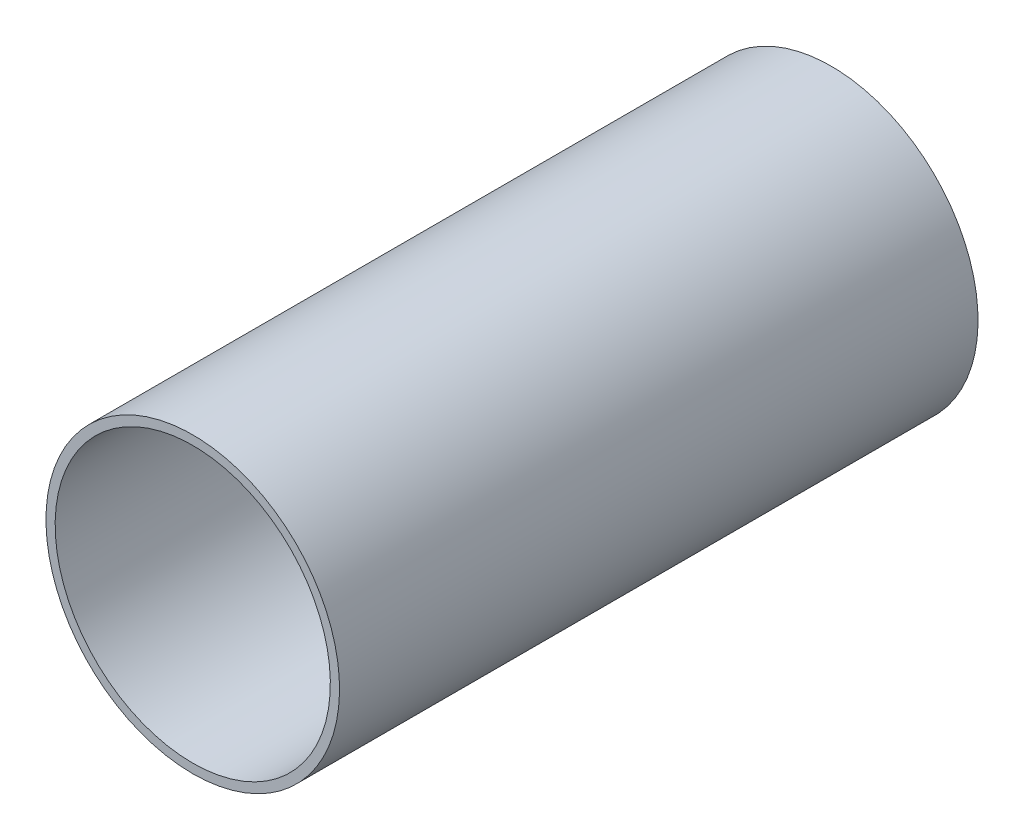
ISO-10303-21;
HEADER;
FILE_DESCRIPTION(('STEP AP214'),'2;1');
FILE_NAME('part.step','',(''),(''),'','','');
FILE_SCHEMA(('AUTOMOTIVE_DESIGN { 1 0 10303 214 1 1 1 1 }'));
ENDSEC;
DATA;
#1=APPLICATION_CONTEXT('core data for automotive mechanical design processes');
#2=APPLICATION_PROTOCOL_DEFINITION('international standard','automotive_design',2000,#1);
#3=PRODUCT_CONTEXT('',#1,'mechanical');
#4=PRODUCT('Part','Part','',(#3));
#5=PRODUCT_RELATED_PRODUCT_CATEGORY('part','',(#4));
#6=PRODUCT_DEFINITION_FORMATION('','',#4);
#7=PRODUCT_DEFINITION_CONTEXT('part definition',#1,'design');
#8=PRODUCT_DEFINITION('design','',#6,#7);
#9=PRODUCT_DEFINITION_SHAPE('','',#8);
#10=(LENGTH_UNIT() NAMED_UNIT(*) SI_UNIT(.MILLI.,.METRE.));
#11=(NAMED_UNIT(*) PLANE_ANGLE_UNIT() SI_UNIT($,.RADIAN.));
#12=(NAMED_UNIT(*) SI_UNIT($,.STERADIAN.) SOLID_ANGLE_UNIT());
#13=UNCERTAINTY_MEASURE_WITH_UNIT(LENGTH_MEASURE(1.E-05),#10,'distance_accuracy_value','');
#14=(GEOMETRIC_REPRESENTATION_CONTEXT(3) GLOBAL_UNCERTAINTY_ASSIGNED_CONTEXT((#13)) GLOBAL_UNIT_ASSIGNED_CONTEXT((#10,
#11,#12)) REPRESENTATION_CONTEXT('',''));
#15=CARTESIAN_POINT('',(0.,0.,0.));
#16=DIRECTION('',(0.,0.,1.));
#17=DIRECTION('',(1.,0.,0.));
#18=AXIS2_PLACEMENT_3D('',#15,#16,#17);
#19=CARTESIAN_POINT('',(129.54,-80.772,-0.045));
#20=DIRECTION('',(0.,0.,-1.));
#21=DIRECTION('',(0.,-1.,0.));
#22=AXIS2_PLACEMENT_3D('',#19,#20,#21);
#23=CYLINDRICAL_SURFACE('',#22,0.375);
#24=CARTESIAN_POINT('',(129.54,-80.772,-0.035));
#25=DIRECTION('',(0.,0.,-1.));
#26=DIRECTION('',(0.,-1.,0.));
#27=AXIS2_PLACEMENT_3D('',#24,#25,#26);
#28=CIRCLE('',#27,0.375);
#29=CARTESIAN_POINT('',(129.54,-81.147,-0.035));
#30=VERTEX_POINT('',#29);
#31=EDGE_CURVE('E65',#30,#30,#28,.T.);
#32=ORIENTED_EDGE('',*,*,#31,.T.);
#33=DIRECTION('',(0.,0.,1.));
#34=VECTOR('',#33,1.);
#35=CARTESIAN_POINT('',(129.54,-81.147,-0.045));
#36=LINE('',#35,#34);
#37=CARTESIAN_POINT('',(129.54,-81.147,1.705));
#38=VERTEX_POINT('',#37);
#39=EDGE_CURVE('E11',#30,#38,#36,.T.);
#40=ORIENTED_EDGE('',*,*,#39,.T.);
#41=CARTESIAN_POINT('',(129.54,-80.772,1.705));
#42=DIRECTION('',(0.,0.,-1.));
#43=DIRECTION('',(0.,-1.,0.));
#44=AXIS2_PLACEMENT_3D('',#41,#42,#43);
#45=CIRCLE('',#44,0.375);
#46=EDGE_CURVE('E20',#38,#38,#45,.T.);
#47=ORIENTED_EDGE('',*,*,#46,.F.);
#48=ORIENTED_EDGE('',*,*,#39,.F.);
#49=EDGE_LOOP('',(#32,#40,#47,#48));
#50=FACE_BOUND('',#49,.T.);
#51=ADVANCED_FACE('F17',(#50),#23,.F.);
#52=CARTESIAN_POINT('',(129.54,-81.172,1.705));
#53=DIRECTION('',(0.,0.,1.));
#54=DIRECTION('',(1.,0.,0.));
#55=AXIS2_PLACEMENT_3D('',#52,#53,#54);
#56=PLANE('',#55);
#57=ORIENTED_EDGE('',*,*,#46,.T.);
#58=EDGE_LOOP('',(#57));
#59=FACE_BOUND('',#58,.T.);
#60=CARTESIAN_POINT('',(129.54,-80.772,1.705));
#61=DIRECTION('',(0.,0.,1.));
#62=DIRECTION('',(0.,-1.,0.));
#63=AXIS2_PLACEMENT_3D('',#60,#61,#62);
#64=CIRCLE('',#63,0.4);
#65=CARTESIAN_POINT('',(129.54,-81.172,1.705));
#66=VERTEX_POINT('',#65);
#67=EDGE_CURVE('E57',#66,#66,#64,.T.);
#68=ORIENTED_EDGE('',*,*,#67,.T.);
#69=EDGE_LOOP('',(#68));
#70=FACE_BOUND('',#69,.T.);
#71=ADVANCED_FACE('F76',(#59,#70),#56,.T.);
#72=CARTESIAN_POINT('',(129.54,-81.172,-0.035));
#73=DIRECTION('',(0.,0.,1.));
#74=DIRECTION('',(1.,0.,0.));
#75=AXIS2_PLACEMENT_3D('',#72,#73,#74);
#76=PLANE('',#75);
#77=ORIENTED_EDGE('',*,*,#31,.F.);
#78=EDGE_LOOP('',(#77));
#79=FACE_BOUND('',#78,.T.);
#80=CARTESIAN_POINT('',(129.54,-80.772,-0.035));
#81=DIRECTION('',(0.,0.,1.));
#82=DIRECTION('',(0.,-1.,0.));
#83=AXIS2_PLACEMENT_3D('',#80,#81,#82);
#84=CIRCLE('',#83,0.4);
#85=CARTESIAN_POINT('',(129.54,-81.172,-0.035));
#86=VERTEX_POINT('',#85);
#87=EDGE_CURVE('E56',#86,#86,#84,.T.);
#88=ORIENTED_EDGE('',*,*,#87,.F.);
#89=EDGE_LOOP('',(#88));
#90=FACE_BOUND('',#89,.T.);
#91=ADVANCED_FACE('F84',(#79,#90),#76,.F.);
#92=CARTESIAN_POINT('',(129.54,-80.772,-0.035));
#93=DIRECTION('',(0.,0.,-1.));
#94=DIRECTION('',(0.,-1.,0.));
#95=AXIS2_PLACEMENT_3D('',#92,#93,#94);
#96=CYLINDRICAL_SURFACE('',#95,0.4);
#97=ORIENTED_EDGE('',*,*,#87,.T.);
#98=DIRECTION('',(0.,0.,1.));
#99=VECTOR('',#98,1.);
#100=CARTESIAN_POINT('',(129.54,-81.172,-0.035));
#101=LINE('',#100,#99);
#102=EDGE_CURVE('E53',#86,#66,#101,.T.);
#103=ORIENTED_EDGE('',*,*,#102,.T.);
#104=ORIENTED_EDGE('',*,*,#67,.F.);
#105=ORIENTED_EDGE('',*,*,#102,.F.);
#106=EDGE_LOOP('',(#97,#103,#104,#105));
#107=FACE_BOUND('',#106,.T.);
#108=ADVANCED_FACE('F54',(#107),#96,.T.);
#109=CLOSED_SHELL('',(#51,#71,#91,#108));
#110=MANIFOLD_SOLID_BREP('B1',#109);
#111=ADVANCED_BREP_SHAPE_REPRESENTATION('',(#18,#110),#14);
#112=SHAPE_DEFINITION_REPRESENTATION(#9,#111);
ENDSEC;
END-ISO-10303-21;
